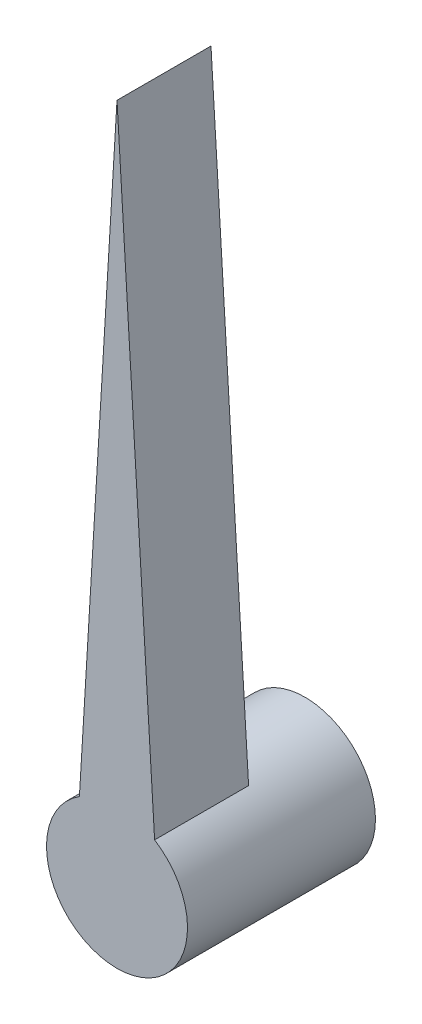
ISO-10303-21;
HEADER;
FILE_DESCRIPTION(('STEP AP214'),'2;1');
FILE_NAME('part.step','',(''),(''),'','','');
FILE_SCHEMA(('AUTOMOTIVE_DESIGN { 1 0 10303 214 1 1 1 1 }'));
ENDSEC;
DATA;
#1=APPLICATION_CONTEXT('core data for automotive mechanical design processes');
#2=APPLICATION_PROTOCOL_DEFINITION('international standard','automotive_design',2000,#1);
#3=PRODUCT_CONTEXT('',#1,'mechanical');
#4=PRODUCT('Part','Part','',(#3));
#5=PRODUCT_RELATED_PRODUCT_CATEGORY('part','',(#4));
#6=PRODUCT_DEFINITION_FORMATION('','',#4);
#7=PRODUCT_DEFINITION_CONTEXT('part definition',#1,'design');
#8=PRODUCT_DEFINITION('design','',#6,#7);
#9=PRODUCT_DEFINITION_SHAPE('','',#8);
#10=(LENGTH_UNIT() NAMED_UNIT(*) SI_UNIT(.MILLI.,.METRE.));
#11=(NAMED_UNIT(*) PLANE_ANGLE_UNIT() SI_UNIT($,.RADIAN.));
#12=(NAMED_UNIT(*) SI_UNIT($,.STERADIAN.) SOLID_ANGLE_UNIT());
#13=UNCERTAINTY_MEASURE_WITH_UNIT(LENGTH_MEASURE(1.E-05),#10,'distance_accuracy_value','');
#14=(GEOMETRIC_REPRESENTATION_CONTEXT(3) GLOBAL_UNCERTAINTY_ASSIGNED_CONTEXT((#13)) GLOBAL_UNIT_ASSIGNED_CONTEXT((#10,
#11,#12)) REPRESENTATION_CONTEXT('',''));
#15=CARTESIAN_POINT('',(0.,0.,0.));
#16=DIRECTION('',(0.,0.,1.));
#17=DIRECTION('',(1.,0.,0.));
#18=AXIS2_PLACEMENT_3D('',#15,#16,#17);
#19=CARTESIAN_POINT('',(0.,0.,10.16));
#20=DIRECTION('',(0.,0.,-1.));
#21=DIRECTION('',(-1.,0.,0.));
#22=AXIS2_PLACEMENT_3D('',#19,#20,#21);
#23=CYLINDRICAL_SURFACE('',#22,3.81);
#24=CARTESIAN_POINT('',(0.,0.,5.08));
#25=DIRECTION('',(0.,0.,1.));
#26=DIRECTION('',(1.,0.,0.));
#27=AXIS2_PLACEMENT_3D('',#24,#25,#26);
#28=CIRCLE('',#27,3.81);
#29=CARTESIAN_POINT('',(2.0323187527507,3.22269770335628,5.08));
#30=VERTEX_POINT('',#29);
#31=CARTESIAN_POINT('',(-2.0323187527507,3.22269770335628,5.08));
#32=VERTEX_POINT('',#31);
#33=EDGE_CURVE('E11',#30,#32,#28,.T.);
#34=ORIENTED_EDGE('',*,*,#33,.F.);
#35=DIRECTION('',(0.,0.,1.));
#36=VECTOR('',#35,1.);
#37=CARTESIAN_POINT('',(2.0323187527507,3.22269770335628,5.08));
#38=LINE('',#37,#36);
#39=CARTESIAN_POINT('',(2.0323187527507,3.22269770335628,10.16));
#40=VERTEX_POINT('',#39);
#41=EDGE_CURVE('E67',#30,#40,#38,.T.);
#42=ORIENTED_EDGE('',*,*,#41,.T.);
#43=CARTESIAN_POINT('',(0.,0.,10.16));
#44=DIRECTION('',(0.,0.,1.));
#45=DIRECTION('',(1.,0.,0.));
#46=AXIS2_PLACEMENT_3D('',#43,#44,#45);
#47=CIRCLE('',#46,3.81);
#48=CARTESIAN_POINT('',(-2.0323187527507,3.22269770335628,10.16));
#49=VERTEX_POINT('',#48);
#50=EDGE_CURVE('E51',#49,#40,#47,.T.);
#51=ORIENTED_EDGE('',*,*,#50,.F.);
#52=DIRECTION('',(0.,0.,1.));
#53=VECTOR('',#52,1.);
#54=CARTESIAN_POINT('',(-2.0323187527507,3.22269770335628,5.08));
#55=LINE('',#54,#53);
#56=EDGE_CURVE('E86',#32,#49,#55,.T.);
#57=ORIENTED_EDGE('',*,*,#56,.F.);
#58=EDGE_LOOP('',(#34,#42,#51,#57));
#59=FACE_BOUND('',#58,.T.);
#60=CARTESIAN_POINT('',(0.,0.,0.));
#61=DIRECTION('',(0.,0.,1.));
#62=DIRECTION('',(1.,0.,0.));
#63=AXIS2_PLACEMENT_3D('',#60,#61,#62);
#64=CIRCLE('',#63,3.81);
#65=CARTESIAN_POINT('',(3.81,0.,0.));
#66=VERTEX_POINT('',#65);
#67=EDGE_CURVE('E108',#66,#66,#64,.T.);
#68=ORIENTED_EDGE('',*,*,#67,.T.);
#69=EDGE_LOOP('',(#68));
#70=FACE_BOUND('',#69,.T.);
#71=ADVANCED_FACE('F43',(#59,#70),#23,.T.);
#72=CARTESIAN_POINT('',(0.,0.,10.16));
#73=DIRECTION('',(0.,0.,1.));
#74=DIRECTION('',(1.,0.,0.));
#75=AXIS2_PLACEMENT_3D('',#72,#73,#74);
#76=PLANE('',#75);
#77=ORIENTED_EDGE('',*,*,#50,.T.);
#78=DIRECTION('',(-0.060362265161443,0.99817653596174,0.));
#79=VECTOR('',#78,1.);
#80=CARTESIAN_POINT('',(0.,36.83,10.16));
#81=LINE('',#80,#79);
#82=CARTESIAN_POINT('',(0.,36.83,10.16));
#83=VERTEX_POINT('',#82);
#84=EDGE_CURVE('E76',#40,#83,#81,.T.);
#85=ORIENTED_EDGE('',*,*,#84,.T.);
#86=DIRECTION('',(-0.060362265161443,-0.99817653596174,0.));
#87=VECTOR('',#86,1.);
#88=CARTESIAN_POINT('',(0.,36.83,10.16));
#89=LINE('',#88,#87);
#90=EDGE_CURVE('E58',#83,#49,#89,.T.);
#91=ORIENTED_EDGE('',*,*,#90,.T.);
#92=EDGE_LOOP('',(#77,#85,#91));
#93=FACE_BOUND('',#92,.T.);
#94=ADVANCED_FACE('F119',(#93),#76,.T.);
#95=CARTESIAN_POINT('',(0.,0.,0.));
#96=DIRECTION('',(0.,0.,1.));
#97=DIRECTION('',(1.,0.,0.));
#98=AXIS2_PLACEMENT_3D('',#95,#96,#97);
#99=PLANE('',#98);
#100=CARTESIAN_POINT('',(0.,0.,0.));
#101=DIRECTION('',(0.,0.,-1.));
#102=DIRECTION('',(-1.,0.,0.));
#103=AXIS2_PLACEMENT_3D('',#100,#101,#102);
#104=CIRCLE('',#103,2.413);
#105=CARTESIAN_POINT('',(-2.413,0.,0.));
#106=VERTEX_POINT('',#105);
#107=EDGE_CURVE('E100',#106,#106,#104,.T.);
#108=ORIENTED_EDGE('',*,*,#107,.F.);
#109=EDGE_LOOP('',(#108));
#110=FACE_BOUND('',#109,.T.);
#111=ORIENTED_EDGE('',*,*,#67,.F.);
#112=EDGE_LOOP('',(#111));
#113=FACE_BOUND('',#112,.T.);
#114=ADVANCED_FACE('F117',(#110,#113),#99,.F.);
#115=CARTESIAN_POINT('',(0.,36.83,5.08));
#116=DIRECTION('',(0.998176535961741,0.0603622651614431,0.));
#117=DIRECTION('',(-0.060362265161443,0.99817653596174,0.));
#118=AXIS2_PLACEMENT_3D('',#115,#116,#117);
#119=PLANE('',#118);
#120=ORIENTED_EDGE('',*,*,#84,.F.);
#121=ORIENTED_EDGE('',*,*,#41,.F.);
#122=DIRECTION('',(-0.060362265161443,0.99817653596174,0.));
#123=VECTOR('',#122,1.);
#124=CARTESIAN_POINT('',(0.,36.83,5.08));
#125=LINE('',#124,#123);
#126=CARTESIAN_POINT('',(0.,36.83,5.08));
#127=VERTEX_POINT('',#126);
#128=EDGE_CURVE('E90',#30,#127,#125,.T.);
#129=ORIENTED_EDGE('',*,*,#128,.T.);
#130=DIRECTION('',(0.,0.,1.));
#131=VECTOR('',#130,1.);
#132=CARTESIAN_POINT('',(0.,36.83,5.08));
#133=LINE('',#132,#131);
#134=EDGE_CURVE('E80',#127,#83,#133,.T.);
#135=ORIENTED_EDGE('',*,*,#134,.T.);
#136=EDGE_LOOP('',(#120,#121,#129,#135));
#137=FACE_BOUND('',#136,.T.);
#138=ADVANCED_FACE('F94',(#137),#119,.T.);
#139=CARTESIAN_POINT('',(0.,36.83,5.08));
#140=DIRECTION('',(-0.998176535961741,0.0603622651614431,0.));
#141=DIRECTION('',(-0.060362265161443,-0.99817653596174,0.));
#142=AXIS2_PLACEMENT_3D('',#139,#140,#141);
#143=PLANE('',#142);
#144=ORIENTED_EDGE('',*,*,#90,.F.);
#145=ORIENTED_EDGE('',*,*,#134,.F.);
#146=DIRECTION('',(-0.060362265161443,-0.99817653596174,0.));
#147=VECTOR('',#146,1.);
#148=CARTESIAN_POINT('',(0.,36.83,5.08));
#149=LINE('',#148,#147);
#150=EDGE_CURVE('E83',#127,#32,#149,.T.);
#151=ORIENTED_EDGE('',*,*,#150,.T.);
#152=ORIENTED_EDGE('',*,*,#56,.T.);
#153=EDGE_LOOP('',(#144,#145,#151,#152));
#154=FACE_BOUND('',#153,.T.);
#155=ADVANCED_FACE('F82',(#154),#143,.T.);
#156=CARTESIAN_POINT('',(0.,0.,5.08));
#157=DIRECTION('',(0.,0.,1.));
#158=DIRECTION('',(1.,0.,0.));
#159=AXIS2_PLACEMENT_3D('',#156,#157,#158);
#160=PLANE('',#159);
#161=ORIENTED_EDGE('',*,*,#128,.F.);
#162=ORIENTED_EDGE('',*,*,#33,.T.);
#163=ORIENTED_EDGE('',*,*,#150,.F.);
#164=EDGE_LOOP('',(#161,#162,#163));
#165=FACE_BOUND('',#164,.T.);
#166=ADVANCED_FACE('F89',(#165),#160,.F.);
#167=CARTESIAN_POINT('',(0.,0.,5.08));
#168=DIRECTION('',(0.,0.,-1.));
#169=DIRECTION('',(-1.,0.,0.));
#170=AXIS2_PLACEMENT_3D('',#167,#168,#169);
#171=CYLINDRICAL_SURFACE('',#170,2.413);
#172=CARTESIAN_POINT('',(0.,0.,5.08));
#173=DIRECTION('',(0.,0.,-1.));
#174=DIRECTION('',(-1.,0.,0.));
#175=AXIS2_PLACEMENT_3D('',#172,#173,#174);
#176=CIRCLE('',#175,2.413);
#177=CARTESIAN_POINT('',(-2.413,0.,5.08));
#178=VERTEX_POINT('',#177);
#179=EDGE_CURVE('E104',#178,#178,#176,.T.);
#180=ORIENTED_EDGE('',*,*,#179,.F.);
#181=EDGE_LOOP('',(#180));
#182=FACE_BOUND('',#181,.T.);
#183=ORIENTED_EDGE('',*,*,#107,.T.);
#184=EDGE_LOOP('',(#183));
#185=FACE_BOUND('',#184,.T.);
#186=ADVANCED_FACE('F163',(#182,#185),#171,.F.);
#187=CARTESIAN_POINT('',(0.,0.,5.08));
#188=DIRECTION('',(0.,0.,-1.));
#189=DIRECTION('',(-1.,0.,0.));
#190=AXIS2_PLACEMENT_3D('',#187,#188,#189);
#191=PLANE('',#190);
#192=ORIENTED_EDGE('',*,*,#179,.T.);
#193=EDGE_LOOP('',(#192));
#194=FACE_BOUND('',#193,.T.);
#195=ADVANCED_FACE('F178',(#194),#191,.T.);
#196=CLOSED_SHELL('',(#71,#94,#114,#138,#155,#166,#186,#195));
#197=MANIFOLD_SOLID_BREP('B2',#196);
#198=ADVANCED_BREP_SHAPE_REPRESENTATION('',(#18,#197),#14);
#199=SHAPE_DEFINITION_REPRESENTATION(#9,#198);
ENDSEC;
END-ISO-10303-21;
